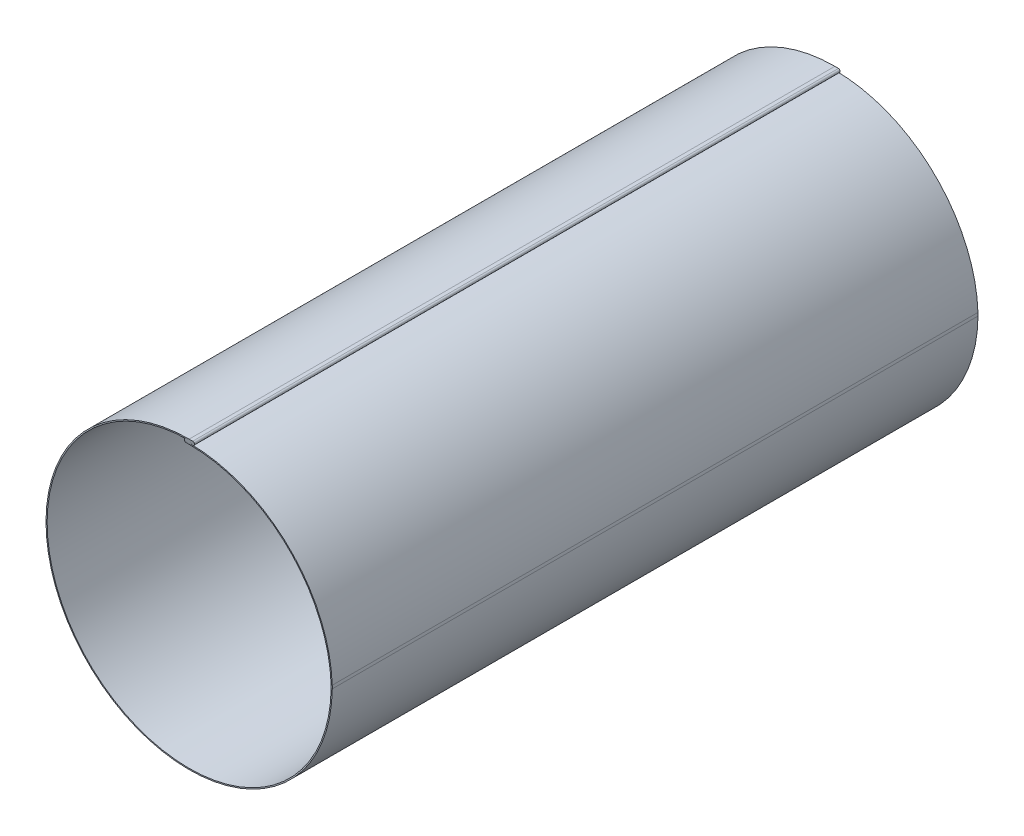
ISO-10303-21;
HEADER;
FILE_DESCRIPTION(('STEP AP214'),'2;1');
FILE_NAME('part.step','',(''),(''),'','','');
FILE_SCHEMA(('AUTOMOTIVE_DESIGN { 1 0 10303 214 1 1 1 1 }'));
ENDSEC;
DATA;
#1=APPLICATION_CONTEXT('core data for automotive mechanical design processes');
#2=APPLICATION_PROTOCOL_DEFINITION('international standard','automotive_design',2000,#1);
#3=PRODUCT_CONTEXT('',#1,'mechanical');
#4=PRODUCT('Part','Part','',(#3));
#5=PRODUCT_RELATED_PRODUCT_CATEGORY('part','',(#4));
#6=PRODUCT_DEFINITION_FORMATION('','',#4);
#7=PRODUCT_DEFINITION_CONTEXT('part definition',#1,'design');
#8=PRODUCT_DEFINITION('design','',#6,#7);
#9=PRODUCT_DEFINITION_SHAPE('','',#8);
#10=(LENGTH_UNIT() NAMED_UNIT(*) SI_UNIT(.MILLI.,.METRE.));
#11=(NAMED_UNIT(*) PLANE_ANGLE_UNIT() SI_UNIT($,.RADIAN.));
#12=(NAMED_UNIT(*) SI_UNIT($,.STERADIAN.) SOLID_ANGLE_UNIT());
#13=UNCERTAINTY_MEASURE_WITH_UNIT(LENGTH_MEASURE(1.E-05),#10,'distance_accuracy_value','');
#14=(GEOMETRIC_REPRESENTATION_CONTEXT(3) GLOBAL_UNCERTAINTY_ASSIGNED_CONTEXT((#13)) GLOBAL_UNIT_ASSIGNED_CONTEXT((#10,
#11,#12)) REPRESENTATION_CONTEXT('',''));
#15=CARTESIAN_POINT('',(0.,0.,0.));
#16=DIRECTION('',(0.,0.,1.));
#17=DIRECTION('',(1.,0.,0.));
#18=AXIS2_PLACEMENT_3D('',#15,#16,#17);
#19=CARTESIAN_POINT('',(0.,158.5,357.5));
#20=DIRECTION('',(0.,0.,1.));
#21=DIRECTION('',(1.,0.,0.));
#22=AXIS2_PLACEMENT_3D('',#19,#20,#21);
#23=PLANE('',#22);
#24=DIRECTION('',(0.,-1.,0.));
#25=VECTOR('',#24,1.);
#26=CARTESIAN_POINT('',(0.,158.5,357.5));
#27=LINE('',#26,#25);
#28=CARTESIAN_POINT('',(0.,158.5,357.5));
#29=VERTEX_POINT('',#28);
#30=CARTESIAN_POINT('',(0.,157.25,357.5));
#31=VERTEX_POINT('',#30);
#32=EDGE_CURVE('E11',#29,#31,#27,.T.);
#33=ORIENTED_EDGE('',*,*,#32,.F.);
#34=CARTESIAN_POINT('',(0.,0.,357.5));
#35=DIRECTION('',(0.,0.,1.));
#36=DIRECTION('',(1.,0.,0.));
#37=AXIS2_PLACEMENT_3D('',#34,#35,#36);
#38=CIRCLE('',#37,158.5);
#39=CARTESIAN_POINT('',(158.490468474023,-1.73821830755222,357.5));
#40=VERTEX_POINT('',#39);
#41=EDGE_CURVE('E170',#29,#40,#38,.T.);
#42=ORIENTED_EDGE('',*,*,#41,.T.);
#43=DIRECTION('',(-0.99993986418942,0.0109666770192557,0.));
#44=VECTOR('',#43,1.);
#45=CARTESIAN_POINT('',(158.490468474023,-1.73821830755222,357.5));
#46=LINE('',#45,#44);
#47=CARTESIAN_POINT('',(157.240543643786,-1.72450996127815,357.5));
#48=VERTEX_POINT('',#47);
#49=EDGE_CURVE('E160',#40,#48,#46,.T.);
#50=ORIENTED_EDGE('',*,*,#49,.T.);
#51=CARTESIAN_POINT('',(0.,0.,357.5));
#52=DIRECTION('',(0.,0.,1.));
#53=DIRECTION('',(1.,0.,0.));
#54=AXIS2_PLACEMENT_3D('',#51,#52,#53);
#55=CIRCLE('',#54,157.25);
#56=EDGE_CURVE('E294',#31,#48,#55,.T.);
#57=ORIENTED_EDGE('',*,*,#56,.F.);
#58=EDGE_LOOP('',(#33,#42,#50,#57));
#59=FACE_BOUND('',#58,.T.);
#60=ADVANCED_FACE('F42',(#59),#23,.T.);
#61=CARTESIAN_POINT('',(0.,157.25,-357.5));
#62=DIRECTION('',(0.,0.,-1.));
#63=DIRECTION('',(-1.,0.,0.));
#64=AXIS2_PLACEMENT_3D('',#61,#62,#63);
#65=PLANE('',#64);
#66=DIRECTION('',(0.,1.,0.));
#67=VECTOR('',#66,1.);
#68=CARTESIAN_POINT('',(0.,157.25,-357.5));
#69=LINE('',#68,#67);
#70=CARTESIAN_POINT('',(0.,157.25,-357.5));
#71=VERTEX_POINT('',#70);
#72=CARTESIAN_POINT('',(0.,158.5,-357.5));
#73=VERTEX_POINT('',#72);
#74=EDGE_CURVE('E50',#71,#73,#69,.T.);
#75=ORIENTED_EDGE('',*,*,#74,.F.);
#76=CARTESIAN_POINT('',(0.,0.,-357.5));
#77=DIRECTION('',(0.,0.,1.));
#78=DIRECTION('',(1.,0.,0.));
#79=AXIS2_PLACEMENT_3D('',#76,#77,#78);
#80=CIRCLE('',#79,157.25);
#81=CARTESIAN_POINT('',(157.240543643786,-1.72450996127815,-357.5));
#82=VERTEX_POINT('',#81);
#83=EDGE_CURVE('E208',#71,#82,#80,.T.);
#84=ORIENTED_EDGE('',*,*,#83,.T.);
#85=DIRECTION('',(0.99993986418942,-0.0109666770192557,0.));
#86=VECTOR('',#85,1.);
#87=CARTESIAN_POINT('',(157.240543643786,-1.72450996127815,-357.5));
#88=LINE('',#87,#86);
#89=CARTESIAN_POINT('',(158.490468474023,-1.73821830755222,-357.5));
#90=VERTEX_POINT('',#89);
#91=EDGE_CURVE('E260',#82,#90,#88,.T.);
#92=ORIENTED_EDGE('',*,*,#91,.T.);
#93=CARTESIAN_POINT('',(0.,0.,-357.5));
#94=DIRECTION('',(0.,0.,1.));
#95=DIRECTION('',(1.,0.,0.));
#96=AXIS2_PLACEMENT_3D('',#93,#94,#95);
#97=CIRCLE('',#96,158.5);
#98=EDGE_CURVE('E220',#73,#90,#97,.T.);
#99=ORIENTED_EDGE('',*,*,#98,.F.);
#100=EDGE_LOOP('',(#75,#84,#92,#99));
#101=FACE_BOUND('',#100,.T.);
#102=ADVANCED_FACE('F283',(#101),#65,.T.);
#103=CARTESIAN_POINT('',(0.732654514278761,154.749281021682,357.5));
#104=DIRECTION('',(0.,0.,1.));
#105=DIRECTION('',(1.,0.,0.));
#106=AXIS2_PLACEMENT_3D('',#103,#104,#105);
#107=PLANE('',#106);
#108=DIRECTION('',(-0.00434262118715934,-0.999990570776157,0.));
#109=VECTOR('',#108,1.);
#110=CARTESIAN_POINT('',(0.732654514278761,154.749281021682,357.5));
#111=LINE('',#110,#109);
#112=CARTESIAN_POINT('',(0.732654514278761,154.749281021682,357.5));
#113=VERTEX_POINT('',#112);
#114=CARTESIAN_POINT('',(0.727226237794811,153.499292808212,357.5));
#115=VERTEX_POINT('',#114);
#116=EDGE_CURVE('E267',#113,#115,#111,.T.);
#117=ORIENTED_EDGE('',*,*,#116,.F.);
#118=CARTESIAN_POINT('',(0.401529648757352,78.5,357.5));
#119=DIRECTION('',(0.,0.,1.));
#120=DIRECTION('',(1.,0.,0.));
#121=AXIS2_PLACEMENT_3D('',#118,#119,#120);
#122=CIRCLE('',#121,76.25);
#123=CARTESIAN_POINT('',(0.401529648757352,154.75,357.5));
#124=VERTEX_POINT('',#123);
#125=EDGE_CURVE('E185',#113,#124,#122,.T.);
#126=ORIENTED_EDGE('',*,*,#125,.T.);
#127=DIRECTION('',(0.,1.,0.));
#128=VECTOR('',#127,1.);
#129=CARTESIAN_POINT('',(0.401529648757352,153.5,357.5));
#130=LINE('',#129,#128);
#131=CARTESIAN_POINT('',(0.401529648757352,153.5,357.5));
#132=VERTEX_POINT('',#131);
#133=EDGE_CURVE('E58',#132,#124,#130,.T.);
#134=ORIENTED_EDGE('',*,*,#133,.F.);
#135=CARTESIAN_POINT('',(0.401529648757352,78.5,357.5));
#136=DIRECTION('',(0.,0.,1.));
#137=DIRECTION('',(1.,0.,0.));
#138=AXIS2_PLACEMENT_3D('',#135,#136,#137);
#139=CIRCLE('',#138,75.);
#140=EDGE_CURVE('E314',#115,#132,#139,.T.);
#141=ORIENTED_EDGE('',*,*,#140,.F.);
#142=EDGE_LOOP('',(#117,#126,#134,#141));
#143=FACE_BOUND('',#142,.T.);
#144=ADVANCED_FACE('F517',(#143),#107,.T.);
#145=CARTESIAN_POINT('',(0.401529648757352,153.5,357.5));
#146=DIRECTION('',(0.,0.,1.));
#147=DIRECTION('',(1.,0.,0.));
#148=AXIS2_PLACEMENT_3D('',#145,#146,#147);
#149=PLANE('',#148);
#150=CARTESIAN_POINT('',(0.0443490561129467,-3.74922444633893,357.5));
#151=DIRECTION('',(0.,0.,1.));
#152=DIRECTION('',(1.,0.,0.));
#153=AXIS2_PLACEMENT_3D('',#150,#151,#152);
#154=CIRCLE('',#153,158.5);
#155=CARTESIAN_POINT('',(158.449354607414,1.73750648312673,357.5));
#156=VERTEX_POINT('',#155);
#157=EDGE_CURVE('E152',#156,#113,#154,.T.);
#158=ORIENTED_EDGE('',*,*,#157,.T.);
#159=ORIENTED_EDGE('',*,*,#116,.T.);
#160=CARTESIAN_POINT('',(0.0443490561129467,-3.74922444633893,357.5));
#161=DIRECTION('',(0.,0.,1.));
#162=DIRECTION('',(1.,0.,0.));
#163=AXIS2_PLACEMENT_3D('',#160,#161,#162);
#164=CIRCLE('',#163,157.25);
#165=CARTESIAN_POINT('',(157.20010377499,1.69423573447164,357.5));
#166=VERTEX_POINT('',#165);
#167=EDGE_CURVE('E155',#166,#115,#164,.T.);
#168=ORIENTED_EDGE('',*,*,#167,.F.);
#169=DIRECTION('',(0.999400665938806,0.0346165989240743,0.));
#170=VECTOR('',#169,1.);
#171=CARTESIAN_POINT('',(157.20010377499,1.69423573447164,357.5));
#172=LINE('',#171,#170);
#173=EDGE_CURVE('E148',#166,#156,#172,.T.);
#174=ORIENTED_EDGE('',*,*,#173,.T.);
#175=EDGE_LOOP('',(#158,#159,#168,#174));
#176=FACE_BOUND('',#175,.T.);
#177=ADVANCED_FACE('F150',(#176),#149,.T.);
#178=CARTESIAN_POINT('',(0.401529648757352,154.75,-357.5));
#179=DIRECTION('',(0.,0.,-1.));
#180=DIRECTION('',(-1.,0.,0.));
#181=AXIS2_PLACEMENT_3D('',#178,#179,#180);
#182=PLANE('',#181);
#183=DIRECTION('',(0.,-1.,0.));
#184=VECTOR('',#183,1.);
#185=CARTESIAN_POINT('',(0.401529648757352,154.75,-357.5));
#186=LINE('',#185,#184);
#187=CARTESIAN_POINT('',(0.401529648757352,154.75,-357.5));
#188=VERTEX_POINT('',#187);
#189=CARTESIAN_POINT('',(0.401529648757352,153.5,-357.5));
#190=VERTEX_POINT('',#189);
#191=EDGE_CURVE('E107',#188,#190,#186,.T.);
#192=ORIENTED_EDGE('',*,*,#191,.F.);
#193=CARTESIAN_POINT('',(0.401529648757352,78.5,-357.5));
#194=DIRECTION('',(0.,0.,1.));
#195=DIRECTION('',(1.,0.,0.));
#196=AXIS2_PLACEMENT_3D('',#193,#194,#195);
#197=CIRCLE('',#196,76.25);
#198=CARTESIAN_POINT('',(0.732654514278761,154.749281021682,-357.5));
#199=VERTEX_POINT('',#198);
#200=EDGE_CURVE('E226',#199,#188,#197,.T.);
#201=ORIENTED_EDGE('',*,*,#200,.F.);
#202=DIRECTION('',(0.00434262118715934,0.999990570776157,0.));
#203=VECTOR('',#202,1.);
#204=CARTESIAN_POINT('',(0.727226237794811,153.499292808212,-357.5));
#205=LINE('',#204,#203);
#206=CARTESIAN_POINT('',(0.727226237794811,153.499292808212,-357.5));
#207=VERTEX_POINT('',#206);
#208=EDGE_CURVE('E100',#207,#199,#205,.T.);
#209=ORIENTED_EDGE('',*,*,#208,.F.);
#210=CARTESIAN_POINT('',(0.401529648757352,78.5,-357.5));
#211=DIRECTION('',(0.,0.,1.));
#212=DIRECTION('',(1.,0.,0.));
#213=AXIS2_PLACEMENT_3D('',#210,#211,#212);
#214=CIRCLE('',#213,75.);
#215=EDGE_CURVE('E201',#207,#190,#214,.T.);
#216=ORIENTED_EDGE('',*,*,#215,.T.);
#217=EDGE_LOOP('',(#192,#201,#209,#216));
#218=FACE_BOUND('',#217,.T.);
#219=ADVANCED_FACE('F307',(#218),#182,.T.);
#220=CARTESIAN_POINT('',(0.727226237794811,153.499292808212,-357.5));
#221=DIRECTION('',(0.,0.,-1.));
#222=DIRECTION('',(-1.,0.,0.));
#223=AXIS2_PLACEMENT_3D('',#220,#221,#222);
#224=PLANE('',#223);
#225=DIRECTION('',(-1.,0.,0.));
#226=VECTOR('',#225,1.);
#227=CARTESIAN_POINT('',(0.540181597477021,154.75,-357.5));
#228=LINE('',#227,#226);
#229=CARTESIAN_POINT('',(-3.45981840252298,154.75,-357.5));
#230=VERTEX_POINT('',#229);
#231=EDGE_CURVE('E191',#188,#230,#228,.T.);
#232=ORIENTED_EDGE('',*,*,#231,.F.);
#233=ORIENTED_EDGE('',*,*,#191,.T.);
#234=DIRECTION('',(1.,0.,0.));
#235=VECTOR('',#234,1.);
#236=CARTESIAN_POINT('',(0.540181597477021,153.5,-357.5));
#237=LINE('',#236,#235);
#238=CARTESIAN_POINT('',(-3.45981840252298,153.5,-357.5));
#239=VERTEX_POINT('',#238);
#240=EDGE_CURVE('E198',#190,#239,#237,.F.);
#241=ORIENTED_EDGE('',*,*,#240,.T.);
#242=DIRECTION('',(0.,1.,0.));
#243=VECTOR('',#242,1.);
#244=CARTESIAN_POINT('',(-3.45981840252298,153.5,-357.5));
#245=LINE('',#244,#243);
#246=EDGE_CURVE('E194',#239,#230,#245,.T.);
#247=ORIENTED_EDGE('',*,*,#246,.T.);
#248=EDGE_LOOP('',(#232,#233,#241,#247));
#249=FACE_BOUND('',#248,.T.);
#250=ADVANCED_FACE('F322',(#249),#224,.T.);
#251=CARTESIAN_POINT('',(158.490468474023,-1.73821830755222,357.5));
#252=DIRECTION('',(0.,0.,1.));
#253=DIRECTION('',(1.,0.,0.));
#254=AXIS2_PLACEMENT_3D('',#251,#252,#253);
#255=PLANE('',#254);
#256=ORIENTED_EDGE('',*,*,#49,.F.);
#257=CARTESIAN_POINT('',(82.2450538295798,-0.902009184833881,357.5));
#258=DIRECTION('',(0.,0.,1.));
#259=DIRECTION('',(1.,0.,0.));
#260=AXIS2_PLACEMENT_3D('',#257,#258,#259);
#261=CIRCLE('',#260,76.25);
#262=EDGE_CURVE('E164',#40,#156,#261,.T.);
#263=ORIENTED_EDGE('',*,*,#262,.T.);
#264=ORIENTED_EDGE('',*,*,#173,.F.);
#265=CARTESIAN_POINT('',(82.2450538295798,-0.902009184833881,357.5));
#266=DIRECTION('',(0.,0.,1.));
#267=DIRECTION('',(1.,0.,0.));
#268=AXIS2_PLACEMENT_3D('',#265,#266,#267);
#269=CIRCLE('',#268,75.);
#270=EDGE_CURVE('E298',#48,#166,#269,.T.);
#271=ORIENTED_EDGE('',*,*,#270,.F.);
#272=EDGE_LOOP('',(#256,#263,#264,#271));
#273=FACE_BOUND('',#272,.T.);
#274=ADVANCED_FACE('F166',(#273),#255,.T.);
#275=CARTESIAN_POINT('',(157.20010377499,1.69423573447164,357.5));
#276=DIRECTION('',(0.,0.,1.));
#277=DIRECTION('',(1.,0.,0.));
#278=AXIS2_PLACEMENT_3D('',#275,#276,#277);
#279=PLANE('',#278);
#280=DIRECTION('',(-1.,0.,0.));
#281=VECTOR('',#280,1.);
#282=CARTESIAN_POINT('',(0.,158.5,357.5));
#283=LINE('',#282,#281);
#284=CARTESIAN_POINT('',(4.,158.5,357.5));
#285=VERTEX_POINT('',#284);
#286=EDGE_CURVE('E446',#285,#29,#283,.T.);
#287=ORIENTED_EDGE('',*,*,#286,.T.);
#288=ORIENTED_EDGE('',*,*,#32,.T.);
#289=DIRECTION('',(1.,0.,0.));
#290=VECTOR('',#289,1.);
#291=CARTESIAN_POINT('',(0.,157.25,357.5));
#292=LINE('',#291,#290);
#293=CARTESIAN_POINT('',(4.,157.25,357.5));
#294=VERTEX_POINT('',#293);
#295=EDGE_CURVE('E440',#294,#31,#292,.F.);
#296=ORIENTED_EDGE('',*,*,#295,.F.);
#297=DIRECTION('',(0.,-1.,0.));
#298=VECTOR('',#297,1.);
#299=CARTESIAN_POINT('',(4.,158.5,357.5));
#300=LINE('',#299,#298);
#301=EDGE_CURVE('E443',#285,#294,#300,.T.);
#302=ORIENTED_EDGE('',*,*,#301,.F.);
#303=EDGE_LOOP('',(#287,#288,#296,#302));
#304=FACE_BOUND('',#303,.T.);
#305=ADVANCED_FACE('F452',(#304),#279,.T.);
#306=CARTESIAN_POINT('',(158.449354607414,1.73750648312673,-357.5));
#307=DIRECTION('',(0.,0.,-1.));
#308=DIRECTION('',(-1.,0.,0.));
#309=AXIS2_PLACEMENT_3D('',#306,#307,#308);
#310=PLANE('',#309);
#311=DIRECTION('',(-0.999400665938806,-0.0346165989240743,0.));
#312=VECTOR('',#311,1.);
#313=CARTESIAN_POINT('',(158.449354607414,1.73750648312673,-357.5));
#314=LINE('',#313,#312);
#315=CARTESIAN_POINT('',(158.449354607414,1.73750648312673,-357.5));
#316=VERTEX_POINT('',#315);
#317=CARTESIAN_POINT('',(157.20010377499,1.69423573447164,-357.5));
#318=VERTEX_POINT('',#317);
#319=EDGE_CURVE('E161',#316,#318,#314,.T.);
#320=ORIENTED_EDGE('',*,*,#319,.F.);
#321=CARTESIAN_POINT('',(82.2450538295798,-0.902009184833881,-357.5));
#322=DIRECTION('',(0.,0.,1.));
#323=DIRECTION('',(1.,0.,0.));
#324=AXIS2_PLACEMENT_3D('',#321,#322,#323);
#325=CIRCLE('',#324,76.25);
#326=EDGE_CURVE('E177',#90,#316,#325,.T.);
#327=ORIENTED_EDGE('',*,*,#326,.F.);
#328=ORIENTED_EDGE('',*,*,#91,.F.);
#329=CARTESIAN_POINT('',(82.2450538295798,-0.902009184833881,-357.5));
#330=DIRECTION('',(0.,0.,1.));
#331=DIRECTION('',(1.,0.,0.));
#332=AXIS2_PLACEMENT_3D('',#329,#330,#331);
#333=CIRCLE('',#332,75.);
#334=EDGE_CURVE('E205',#82,#318,#333,.T.);
#335=ORIENTED_EDGE('',*,*,#334,.T.);
#336=EDGE_LOOP('',(#320,#327,#328,#335));
#337=FACE_BOUND('',#336,.T.);
#338=ADVANCED_FACE('F286',(#337),#310,.T.);
#339=CARTESIAN_POINT('',(157.240543643786,-1.72450996127815,-357.5));
#340=DIRECTION('',(0.,0.,-1.));
#341=DIRECTION('',(-1.,0.,0.));
#342=AXIS2_PLACEMENT_3D('',#339,#340,#341);
#343=PLANE('',#342);
#344=CARTESIAN_POINT('',(0.0443490561129467,-3.74922444633893,-357.5));
#345=DIRECTION('',(0.,0.,1.));
#346=DIRECTION('',(1.,0.,0.));
#347=AXIS2_PLACEMENT_3D('',#344,#345,#346);
#348=CIRCLE('',#347,158.5);
#349=EDGE_CURVE('E224',#316,#199,#348,.T.);
#350=ORIENTED_EDGE('',*,*,#349,.F.);
#351=ORIENTED_EDGE('',*,*,#319,.T.);
#352=CARTESIAN_POINT('',(0.0443490561129467,-3.74922444633893,-357.5));
#353=DIRECTION('',(0.,0.,1.));
#354=DIRECTION('',(1.,0.,0.));
#355=AXIS2_PLACEMENT_3D('',#352,#353,#354);
#356=CIRCLE('',#355,157.25);
#357=EDGE_CURVE('E203',#318,#207,#356,.T.);
#358=ORIENTED_EDGE('',*,*,#357,.T.);
#359=ORIENTED_EDGE('',*,*,#208,.T.);
#360=EDGE_LOOP('',(#350,#351,#358,#359));
#361=FACE_BOUND('',#360,.T.);
#362=ADVANCED_FACE('F303',(#361),#343,.T.);
#363=CARTESIAN_POINT('',(0.540181597477021,154.75,357.5));
#364=DIRECTION('',(0.,-1.,0.));
#365=DIRECTION('',(0.,0.,-1.));
#366=AXIS2_PLACEMENT_3D('',#363,#364,#365);
#367=PLANE('',#366);
#368=ORIENTED_EDGE('',*,*,#231,.T.);
#369=DIRECTION('',(0.,0.,-1.));
#370=VECTOR('',#369,1.);
#371=CARTESIAN_POINT('',(-3.45981840252298,154.75,357.5));
#372=LINE('',#371,#370);
#373=CARTESIAN_POINT('',(-3.45981840252298,154.75,357.5));
#374=VERTEX_POINT('',#373);
#375=EDGE_CURVE('E257',#374,#230,#372,.T.);
#376=ORIENTED_EDGE('',*,*,#375,.F.);
#377=DIRECTION('',(-1.,0.,0.));
#378=VECTOR('',#377,1.);
#379=CARTESIAN_POINT('',(0.540181597477021,154.75,357.5));
#380=LINE('',#379,#378);
#381=EDGE_CURVE('E113',#124,#374,#380,.T.);
#382=ORIENTED_EDGE('',*,*,#381,.F.);
#383=DIRECTION('',(0.,0.,-1.));
#384=VECTOR('',#383,1.);
#385=CARTESIAN_POINT('',(0.401529648757352,154.75,357.5));
#386=LINE('',#385,#384);
#387=EDGE_CURVE('E187',#124,#188,#386,.T.);
#388=ORIENTED_EDGE('',*,*,#387,.T.);
#389=EDGE_LOOP('',(#368,#376,#382,#388));
#390=FACE_BOUND('',#389,.T.);
#391=ADVANCED_FACE('F538',(#390),#367,.F.);
#392=CARTESIAN_POINT('',(0.540181597477021,153.5,357.5));
#393=DIRECTION('',(0.,-1.,0.));
#394=DIRECTION('',(0.,0.,-1.));
#395=AXIS2_PLACEMENT_3D('',#392,#393,#394);
#396=PLANE('',#395);
#397=ORIENTED_EDGE('',*,*,#240,.F.);
#398=DIRECTION('',(0.,0.,-1.));
#399=VECTOR('',#398,1.);
#400=CARTESIAN_POINT('',(0.401529648757352,153.5,357.5));
#401=LINE('',#400,#399);
#402=EDGE_CURVE('E252',#132,#190,#401,.T.);
#403=ORIENTED_EDGE('',*,*,#402,.F.);
#404=DIRECTION('',(1.,0.,0.));
#405=VECTOR('',#404,1.);
#406=CARTESIAN_POINT('',(0.540181597477021,153.5,357.5));
#407=LINE('',#406,#405);
#408=CARTESIAN_POINT('',(-3.45981840252298,153.5,357.5));
#409=VERTEX_POINT('',#408);
#410=EDGE_CURVE('E434',#132,#409,#407,.F.);
#411=ORIENTED_EDGE('',*,*,#410,.T.);
#412=DIRECTION('',(0.,0.,-1.));
#413=VECTOR('',#412,1.);
#414=CARTESIAN_POINT('',(-3.45981840252298,153.5,357.5));
#415=LINE('',#414,#413);
#416=EDGE_CURVE('E255',#409,#239,#415,.T.);
#417=ORIENTED_EDGE('',*,*,#416,.T.);
#418=EDGE_LOOP('',(#397,#403,#411,#417));
#419=FACE_BOUND('',#418,.T.);
#420=ADVANCED_FACE('F317',(#419),#396,.T.);
#421=CARTESIAN_POINT('',(0.401529648757352,78.5,357.5));
#422=DIRECTION('',(0.,0.,-1.));
#423=DIRECTION('',(-1.,0.,0.));
#424=AXIS2_PLACEMENT_3D('',#421,#422,#423);
#425=CYLINDRICAL_SURFACE('',#424,75.);
#426=ORIENTED_EDGE('',*,*,#215,.F.);
#427=DIRECTION('',(0.,0.,-1.));
#428=VECTOR('',#427,1.);
#429=CARTESIAN_POINT('',(0.727226237794811,153.499292808212,357.5));
#430=LINE('',#429,#428);
#431=EDGE_CURVE('E249',#115,#207,#430,.T.);
#432=ORIENTED_EDGE('',*,*,#431,.F.);
#433=ORIENTED_EDGE('',*,*,#140,.T.);
#434=ORIENTED_EDGE('',*,*,#402,.T.);
#435=EDGE_LOOP('',(#426,#432,#433,#434));
#436=FACE_BOUND('',#435,.T.);
#437=ADVANCED_FACE('F309',(#436),#425,.F.);
#438=CARTESIAN_POINT('',(0.0443490561129467,-3.74922444633893,357.5));
#439=DIRECTION('',(0.,0.,-1.));
#440=DIRECTION('',(-1.,0.,0.));
#441=AXIS2_PLACEMENT_3D('',#438,#439,#440);
#442=CYLINDRICAL_SURFACE('',#441,157.25);
#443=ORIENTED_EDGE('',*,*,#357,.F.);
#444=DIRECTION('',(0.,0.,-1.));
#445=VECTOR('',#444,1.);
#446=CARTESIAN_POINT('',(157.20010377499,1.69423573447164,357.5));
#447=LINE('',#446,#445);
#448=EDGE_CURVE('E246',#166,#318,#447,.T.);
#449=ORIENTED_EDGE('',*,*,#448,.F.);
#450=ORIENTED_EDGE('',*,*,#167,.T.);
#451=ORIENTED_EDGE('',*,*,#431,.T.);
#452=EDGE_LOOP('',(#443,#449,#450,#451));
#453=FACE_BOUND('',#452,.T.);
#454=ADVANCED_FACE('F300',(#453),#442,.F.);
#455=CARTESIAN_POINT('',(82.2450538295798,-0.902009184833881,357.5));
#456=DIRECTION('',(0.,0.,-1.));
#457=DIRECTION('',(-1.,0.,0.));
#458=AXIS2_PLACEMENT_3D('',#455,#456,#457);
#459=CYLINDRICAL_SURFACE('',#458,75.);
#460=ORIENTED_EDGE('',*,*,#334,.F.);
#461=DIRECTION('',(0.,0.,-1.));
#462=VECTOR('',#461,1.);
#463=CARTESIAN_POINT('',(157.240543643786,-1.72450996127815,357.5));
#464=LINE('',#463,#462);
#465=EDGE_CURVE('E243',#48,#82,#464,.T.);
#466=ORIENTED_EDGE('',*,*,#465,.F.);
#467=ORIENTED_EDGE('',*,*,#270,.T.);
#468=ORIENTED_EDGE('',*,*,#448,.T.);
#469=EDGE_LOOP('',(#460,#466,#467,#468));
#470=FACE_BOUND('',#469,.T.);
#471=ADVANCED_FACE('F296',(#470),#459,.F.);
#472=CARTESIAN_POINT('',(0.,0.,357.5));
#473=DIRECTION('',(0.,0.,-1.));
#474=DIRECTION('',(-1.,0.,0.));
#475=AXIS2_PLACEMENT_3D('',#472,#473,#474);
#476=CYLINDRICAL_SURFACE('',#475,157.25);
#477=ORIENTED_EDGE('',*,*,#83,.F.);
#478=DIRECTION('',(0.,0.,-1.));
#479=VECTOR('',#478,1.);
#480=CARTESIAN_POINT('',(0.,157.25,357.5));
#481=LINE('',#480,#479);
#482=EDGE_CURVE('E240',#31,#71,#481,.T.);
#483=ORIENTED_EDGE('',*,*,#482,.F.);
#484=ORIENTED_EDGE('',*,*,#56,.T.);
#485=ORIENTED_EDGE('',*,*,#465,.T.);
#486=EDGE_LOOP('',(#477,#483,#484,#485));
#487=FACE_BOUND('',#486,.T.);
#488=ADVANCED_FACE('F291',(#487),#476,.F.);
#489=CARTESIAN_POINT('',(0.,157.25,357.5));
#490=DIRECTION('',(0.,-1.,0.));
#491=DIRECTION('',(0.,0.,-1.));
#492=AXIS2_PLACEMENT_3D('',#489,#490,#491);
#493=PLANE('',#492);
#494=DIRECTION('',(1.,0.,0.));
#495=VECTOR('',#494,1.);
#496=CARTESIAN_POINT('',(0.,157.25,-357.5));
#497=LINE('',#496,#495);
#498=CARTESIAN_POINT('',(4.,157.25,-357.5));
#499=VERTEX_POINT('',#498);
#500=EDGE_CURVE('E211',#499,#71,#497,.F.);
#501=ORIENTED_EDGE('',*,*,#500,.F.);
#502=DIRECTION('',(0.,0.,-1.));
#503=VECTOR('',#502,1.);
#504=CARTESIAN_POINT('',(4.,157.25,357.5));
#505=LINE('',#504,#503);
#506=EDGE_CURVE('E237',#294,#499,#505,.T.);
#507=ORIENTED_EDGE('',*,*,#506,.F.);
#508=ORIENTED_EDGE('',*,*,#295,.T.);
#509=ORIENTED_EDGE('',*,*,#482,.T.);
#510=EDGE_LOOP('',(#501,#507,#508,#509));
#511=FACE_BOUND('',#510,.T.);
#512=ADVANCED_FACE('F552',(#511),#493,.T.);
#513=CARTESIAN_POINT('',(0.,158.5,357.5));
#514=DIRECTION('',(0.,-1.,0.));
#515=DIRECTION('',(0.,0.,-1.));
#516=AXIS2_PLACEMENT_3D('',#513,#514,#515);
#517=PLANE('',#516);
#518=DIRECTION('',(-1.,0.,0.));
#519=VECTOR('',#518,1.);
#520=CARTESIAN_POINT('',(0.,158.5,-357.5));
#521=LINE('',#520,#519);
#522=CARTESIAN_POINT('',(4.,158.5,-357.5));
#523=VERTEX_POINT('',#522);
#524=EDGE_CURVE('E217',#523,#73,#521,.T.);
#525=ORIENTED_EDGE('',*,*,#524,.T.);
#526=DIRECTION('',(0.,0.,-1.));
#527=VECTOR('',#526,1.);
#528=CARTESIAN_POINT('',(0.,158.5,357.5));
#529=LINE('',#528,#527);
#530=EDGE_CURVE('E232',#29,#73,#529,.T.);
#531=ORIENTED_EDGE('',*,*,#530,.F.);
#532=ORIENTED_EDGE('',*,*,#286,.F.);
#533=DIRECTION('',(0.,0.,-1.));
#534=VECTOR('',#533,1.);
#535=CARTESIAN_POINT('',(4.,158.5,357.5));
#536=LINE('',#535,#534);
#537=EDGE_CURVE('E235',#285,#523,#536,.T.);
#538=ORIENTED_EDGE('',*,*,#537,.T.);
#539=EDGE_LOOP('',(#525,#531,#532,#538));
#540=FACE_BOUND('',#539,.T.);
#541=ADVANCED_FACE('F277',(#540),#517,.F.);
#542=CARTESIAN_POINT('',(0.,0.,357.5));
#543=DIRECTION('',(0.,0.,-1.));
#544=DIRECTION('',(-1.,0.,0.));
#545=AXIS2_PLACEMENT_3D('',#542,#543,#544);
#546=CYLINDRICAL_SURFACE('',#545,158.5);
#547=ORIENTED_EDGE('',*,*,#98,.T.);
#548=DIRECTION('',(0.,0.,-1.));
#549=VECTOR('',#548,1.);
#550=CARTESIAN_POINT('',(158.490468474023,-1.73821830755222,357.5));
#551=LINE('',#550,#549);
#552=EDGE_CURVE('E179',#40,#90,#551,.T.);
#553=ORIENTED_EDGE('',*,*,#552,.F.);
#554=ORIENTED_EDGE('',*,*,#41,.F.);
#555=ORIENTED_EDGE('',*,*,#530,.T.);
#556=EDGE_LOOP('',(#547,#553,#554,#555));
#557=FACE_BOUND('',#556,.T.);
#558=ADVANCED_FACE('F281',(#557),#546,.T.);
#559=CARTESIAN_POINT('',(82.2450538295798,-0.902009184833881,357.5));
#560=DIRECTION('',(0.,0.,-1.));
#561=DIRECTION('',(-1.,0.,0.));
#562=AXIS2_PLACEMENT_3D('',#559,#560,#561);
#563=CYLINDRICAL_SURFACE('',#562,76.25);
#564=ORIENTED_EDGE('',*,*,#326,.T.);
#565=DIRECTION('',(0.,0.,-1.));
#566=VECTOR('',#565,1.);
#567=CARTESIAN_POINT('',(158.449354607414,1.73750648312673,357.5));
#568=LINE('',#567,#566);
#569=EDGE_CURVE('E174',#156,#316,#568,.T.);
#570=ORIENTED_EDGE('',*,*,#569,.F.);
#571=ORIENTED_EDGE('',*,*,#262,.F.);
#572=ORIENTED_EDGE('',*,*,#552,.T.);
#573=EDGE_LOOP('',(#564,#570,#571,#572));
#574=FACE_BOUND('',#573,.T.);
#575=ADVANCED_FACE('F175',(#574),#563,.T.);
#576=CARTESIAN_POINT('',(0.0443490561129467,-3.74922444633893,357.5));
#577=DIRECTION('',(0.,0.,-1.));
#578=DIRECTION('',(-1.,0.,0.));
#579=AXIS2_PLACEMENT_3D('',#576,#577,#578);
#580=CYLINDRICAL_SURFACE('',#579,158.5);
#581=ORIENTED_EDGE('',*,*,#349,.T.);
#582=DIRECTION('',(0.,0.,-1.));
#583=VECTOR('',#582,1.);
#584=CARTESIAN_POINT('',(0.732654514278761,154.749281021682,357.5));
#585=LINE('',#584,#583);
#586=EDGE_CURVE('E180',#113,#199,#585,.T.);
#587=ORIENTED_EDGE('',*,*,#586,.F.);
#588=ORIENTED_EDGE('',*,*,#157,.F.);
#589=ORIENTED_EDGE('',*,*,#569,.T.);
#590=EDGE_LOOP('',(#581,#587,#588,#589));
#591=FACE_BOUND('',#590,.T.);
#592=ADVANCED_FACE('F182',(#591),#580,.T.);
#593=CARTESIAN_POINT('',(0.401529648757352,78.5,357.5));
#594=DIRECTION('',(0.,0.,-1.));
#595=DIRECTION('',(-1.,0.,0.));
#596=AXIS2_PLACEMENT_3D('',#593,#594,#595);
#597=CYLINDRICAL_SURFACE('',#596,76.25);
#598=ORIENTED_EDGE('',*,*,#200,.T.);
#599=ORIENTED_EDGE('',*,*,#387,.F.);
#600=ORIENTED_EDGE('',*,*,#125,.F.);
#601=ORIENTED_EDGE('',*,*,#586,.T.);
#602=EDGE_LOOP('',(#598,#599,#600,#601));
#603=FACE_BOUND('',#602,.T.);
#604=ADVANCED_FACE('F305',(#603),#597,.T.);
#605=CARTESIAN_POINT('',(0.401529648757352,78.5,357.5));
#606=DIRECTION('',(0.,0.,1.));
#607=DIRECTION('',(1.,0.,0.));
#608=AXIS2_PLACEMENT_3D('',#605,#606,#607);
#609=PLANE('',#608);
#610=ORIENTED_EDGE('',*,*,#381,.T.);
#611=DIRECTION('',(0.,1.,0.));
#612=VECTOR('',#611,1.);
#613=CARTESIAN_POINT('',(-3.45981840252298,153.5,357.5));
#614=LINE('',#613,#612);
#615=EDGE_CURVE('E431',#409,#374,#614,.T.);
#616=ORIENTED_EDGE('',*,*,#615,.F.);
#617=ORIENTED_EDGE('',*,*,#410,.F.);
#618=ORIENTED_EDGE('',*,*,#133,.T.);
#619=EDGE_LOOP('',(#610,#616,#617,#618));
#620=FACE_BOUND('',#619,.T.);
#621=ADVANCED_FACE('F566',(#620),#609,.T.);
#622=CARTESIAN_POINT('',(0.401529648757352,78.5,-357.5));
#623=DIRECTION('',(0.,0.,1.));
#624=DIRECTION('',(1.,0.,0.));
#625=AXIS2_PLACEMENT_3D('',#622,#623,#624);
#626=PLANE('',#625);
#627=ORIENTED_EDGE('',*,*,#500,.T.);
#628=ORIENTED_EDGE('',*,*,#74,.T.);
#629=ORIENTED_EDGE('',*,*,#524,.F.);
#630=DIRECTION('',(0.,-1.,0.));
#631=VECTOR('',#630,1.);
#632=CARTESIAN_POINT('',(4.,158.5,-357.5));
#633=LINE('',#632,#631);
#634=EDGE_CURVE('E214',#523,#499,#633,.T.);
#635=ORIENTED_EDGE('',*,*,#634,.T.);
#636=EDGE_LOOP('',(#627,#628,#629,#635));
#637=FACE_BOUND('',#636,.T.);
#638=ADVANCED_FACE('F270',(#637),#626,.F.);
#639=CARTESIAN_POINT('',(-0.0625000000000001,154.75,357.5));
#640=DIRECTION('',(0.,0.,-1.));
#641=DIRECTION('',(1.,0.,0.));
#642=AXIS2_PLACEMENT_3D('',#639,#640,#641);
#643=PLANE('',#642);
#644=DIRECTION('',(0.,-1.,0.));
#645=VECTOR('',#644,1.);
#646=CARTESIAN_POINT('',(4.,154.75,357.5));
#647=LINE('',#646,#645);
#648=CARTESIAN_POINT('',(4.,156.,357.5));
#649=VERTEX_POINT('',#648);
#650=CARTESIAN_POINT('',(4.,154.75,357.5));
#651=VERTEX_POINT('',#650);
#652=EDGE_CURVE('E423',#649,#651,#647,.T.);
#653=ORIENTED_EDGE('',*,*,#652,.F.);
#654=DIRECTION('',(1.,0.,0.));
#655=VECTOR('',#654,1.);
#656=CARTESIAN_POINT('',(-0.0625000000000001,156.,357.5));
#657=LINE('',#656,#655);
#658=CARTESIAN_POINT('',(-4.125,156.,357.5));
#659=VERTEX_POINT('',#658);
#660=EDGE_CURVE('E412',#659,#649,#657,.T.);
#661=ORIENTED_EDGE('',*,*,#660,.F.);
#662=DIRECTION('',(0.,-1.,0.));
#663=VECTOR('',#662,1.);
#664=CARTESIAN_POINT('',(-4.125,154.75,357.5));
#665=LINE('',#664,#663);
#666=CARTESIAN_POINT('',(-4.125,154.75,357.5));
#667=VERTEX_POINT('',#666);
#668=EDGE_CURVE('E420',#659,#667,#665,.T.);
#669=ORIENTED_EDGE('',*,*,#668,.T.);
#670=DIRECTION('',(1.,0.,0.));
#671=VECTOR('',#670,1.);
#672=CARTESIAN_POINT('',(-0.0625000000000001,154.75,357.5));
#673=LINE('',#672,#671);
#674=EDGE_CURVE('E400',#667,#651,#673,.T.);
#675=ORIENTED_EDGE('',*,*,#674,.T.);
#676=EDGE_LOOP('',(#653,#661,#669,#675));
#677=FACE_BOUND('',#676,.T.);
#678=ADVANCED_FACE('F467',(#677),#643,.F.);
#679=CARTESIAN_POINT('',(-4.125,154.75,0.));
#680=DIRECTION('',(1.,0.,0.));
#681=DIRECTION('',(0.,0.,1.));
#682=AXIS2_PLACEMENT_3D('',#679,#680,#681);
#683=PLANE('',#682);
#684=ORIENTED_EDGE('',*,*,#668,.F.);
#685=DIRECTION('',(0.,0.,-1.));
#686=VECTOR('',#685,1.);
#687=CARTESIAN_POINT('',(-4.125,156.,0.));
#688=LINE('',#687,#686);
#689=CARTESIAN_POINT('',(-4.125,156.,-357.5));
#690=VERTEX_POINT('',#689);
#691=EDGE_CURVE('E409',#690,#659,#688,.F.);
#692=ORIENTED_EDGE('',*,*,#691,.F.);
#693=DIRECTION('',(0.,-1.,0.));
#694=VECTOR('',#693,1.);
#695=CARTESIAN_POINT('',(-4.125,154.75,-357.5));
#696=LINE('',#695,#694);
#697=CARTESIAN_POINT('',(-4.125,154.75,-357.5));
#698=VERTEX_POINT('',#697);
#699=EDGE_CURVE('E399',#690,#698,#696,.T.);
#700=ORIENTED_EDGE('',*,*,#699,.T.);
#701=DIRECTION('',(0.,0.,1.));
#702=VECTOR('',#701,1.);
#703=CARTESIAN_POINT('',(-4.125,154.75,0.));
#704=LINE('',#703,#702);
#705=EDGE_CURVE('E396',#698,#667,#704,.T.);
#706=ORIENTED_EDGE('',*,*,#705,.T.);
#707=EDGE_LOOP('',(#684,#692,#700,#706));
#708=FACE_BOUND('',#707,.T.);
#709=ADVANCED_FACE('F502',(#708),#683,.F.);
#710=CARTESIAN_POINT('',(-0.0625000000000001,154.75,-357.5));
#711=DIRECTION('',(0.,0.,1.));
#712=DIRECTION('',(-1.,0.,0.));
#713=AXIS2_PLACEMENT_3D('',#710,#711,#712);
#714=PLANE('',#713);
#715=DIRECTION('',(1.,0.,0.));
#716=VECTOR('',#715,1.);
#717=CARTESIAN_POINT('',(-0.0625000000000001,156.,-357.5));
#718=LINE('',#717,#716);
#719=CARTESIAN_POINT('',(4.,156.,-357.5));
#720=VERTEX_POINT('',#719);
#721=EDGE_CURVE('E387',#720,#690,#718,.F.);
#722=ORIENTED_EDGE('',*,*,#721,.F.);
#723=DIRECTION('',(0.,-1.,0.));
#724=VECTOR('',#723,1.);
#725=CARTESIAN_POINT('',(4.,154.75,-357.5));
#726=LINE('',#725,#724);
#727=CARTESIAN_POINT('',(4.,154.75,-357.5));
#728=VERTEX_POINT('',#727);
#729=EDGE_CURVE('E195',#720,#728,#726,.T.);
#730=ORIENTED_EDGE('',*,*,#729,.T.);
#731=DIRECTION('',(-1.,0.,0.));
#732=VECTOR('',#731,1.);
#733=CARTESIAN_POINT('',(-0.0625000000000001,154.75,-357.5));
#734=LINE('',#733,#732);
#735=EDGE_CURVE('E406',#728,#698,#734,.T.);
#736=ORIENTED_EDGE('',*,*,#735,.T.);
#737=ORIENTED_EDGE('',*,*,#699,.F.);
#738=EDGE_LOOP('',(#722,#730,#736,#737));
#739=FACE_BOUND('',#738,.T.);
#740=ADVANCED_FACE('F500',(#739),#714,.F.);
#741=CARTESIAN_POINT('',(-0.0625000000000001,154.75,0.));
#742=DIRECTION('',(0.,-1.,0.));
#743=DIRECTION('',(0.,0.,-1.));
#744=AXIS2_PLACEMENT_3D('',#741,#742,#743);
#745=PLANE('',#744);
#746=ORIENTED_EDGE('',*,*,#705,.F.);
#747=ORIENTED_EDGE('',*,*,#735,.F.);
#748=DIRECTION('',(0.,0.,-1.));
#749=VECTOR('',#748,1.);
#750=CARTESIAN_POINT('',(4.,154.75,0.));
#751=LINE('',#750,#749);
#752=EDGE_CURVE('E403',#651,#728,#751,.T.);
#753=ORIENTED_EDGE('',*,*,#752,.F.);
#754=ORIENTED_EDGE('',*,*,#674,.F.);
#755=EDGE_LOOP('',(#746,#747,#753,#754));
#756=FACE_BOUND('',#755,.T.);
#757=ADVANCED_FACE('F509',(#756),#745,.T.);
#758=CARTESIAN_POINT('',(-0.0625000000000001,156.,0.));
#759=DIRECTION('',(0.,-1.,0.));
#760=DIRECTION('',(0.,0.,-1.));
#761=AXIS2_PLACEMENT_3D('',#758,#759,#760);
#762=PLANE('',#761);
#763=ORIENTED_EDGE('',*,*,#691,.T.);
#764=ORIENTED_EDGE('',*,*,#660,.T.);
#765=DIRECTION('',(0.,0.,-1.));
#766=VECTOR('',#765,1.);
#767=CARTESIAN_POINT('',(4.,156.,0.));
#768=LINE('',#767,#766);
#769=EDGE_CURVE('E415',#649,#720,#768,.T.);
#770=ORIENTED_EDGE('',*,*,#769,.T.);
#771=ORIENTED_EDGE('',*,*,#721,.T.);
#772=EDGE_LOOP('',(#763,#764,#770,#771));
#773=FACE_BOUND('',#772,.T.);
#774=ADVANCED_FACE('F474',(#773),#762,.F.);
#775=CARTESIAN_POINT('',(4.,156.625,-357.5));
#776=DIRECTION('',(0.,0.,-1.));
#777=DIRECTION('',(-1.,0.,0.));
#778=AXIS2_PLACEMENT_3D('',#775,#776,#777);
#779=PLANE('',#778);
#780=ORIENTED_EDGE('',*,*,#729,.F.);
#781=CARTESIAN_POINT('',(4.,156.625,-357.5));
#782=DIRECTION('',(0.,0.,1.));
#783=DIRECTION('',(1.,0.,0.));
#784=AXIS2_PLACEMENT_3D('',#781,#782,#783);
#785=CIRCLE('',#784,0.625000000000014);
#786=EDGE_CURVE('E391',#499,#720,#785,.F.);
#787=ORIENTED_EDGE('',*,*,#786,.F.);
#788=ORIENTED_EDGE('',*,*,#634,.F.);
#789=CARTESIAN_POINT('',(4.,156.625,-357.5));
#790=DIRECTION('',(0.,0.,1.));
#791=DIRECTION('',(1.,0.,0.));
#792=AXIS2_PLACEMENT_3D('',#789,#790,#791);
#793=CIRCLE('',#792,1.87500000000001);
#794=EDGE_CURVE('E384',#523,#728,#793,.F.);
#795=ORIENTED_EDGE('',*,*,#794,.T.);
#796=EDGE_LOOP('',(#780,#787,#788,#795));
#797=FACE_BOUND('',#796,.T.);
#798=ADVANCED_FACE('F484',(#797),#779,.T.);
#799=CARTESIAN_POINT('',(4.,156.625,357.5));
#800=DIRECTION('',(0.,0.,-1.));
#801=DIRECTION('',(-1.,0.,0.));
#802=AXIS2_PLACEMENT_3D('',#799,#800,#801);
#803=PLANE('',#802);
#804=CARTESIAN_POINT('',(4.,156.625,357.5));
#805=DIRECTION('',(0.,0.,1.));
#806=DIRECTION('',(1.,0.,0.));
#807=AXIS2_PLACEMENT_3D('',#804,#805,#806);
#808=CIRCLE('',#807,0.625000000000014);
#809=EDGE_CURVE('E381',#649,#294,#808,.T.);
#810=ORIENTED_EDGE('',*,*,#809,.F.);
#811=ORIENTED_EDGE('',*,*,#652,.T.);
#812=CARTESIAN_POINT('',(4.,156.625,357.5));
#813=DIRECTION('',(0.,0.,1.));
#814=DIRECTION('',(1.,0.,0.));
#815=AXIS2_PLACEMENT_3D('',#812,#813,#814);
#816=CIRCLE('',#815,1.87500000000001);
#817=EDGE_CURVE('E388',#651,#285,#816,.T.);
#818=ORIENTED_EDGE('',*,*,#817,.T.);
#819=ORIENTED_EDGE('',*,*,#301,.T.);
#820=EDGE_LOOP('',(#810,#811,#818,#819));
#821=FACE_BOUND('',#820,.T.);
#822=ADVANCED_FACE('F459',(#821),#803,.F.);
#823=CARTESIAN_POINT('',(4.,156.625,357.5));
#824=DIRECTION('',(0.,0.,1.));
#825=DIRECTION('',(0.,-1.,0.));
#826=AXIS2_PLACEMENT_3D('',#823,#824,#825);
#827=CYLINDRICAL_SURFACE('',#826,1.87500000000001);
#828=ORIENTED_EDGE('',*,*,#537,.F.);
#829=ORIENTED_EDGE('',*,*,#817,.F.);
#830=ORIENTED_EDGE('',*,*,#752,.T.);
#831=ORIENTED_EDGE('',*,*,#794,.F.);
#832=EDGE_LOOP('',(#828,#829,#830,#831));
#833=FACE_BOUND('',#832,.T.);
#834=ADVANCED_FACE('F458',(#833),#827,.T.);
#835=CARTESIAN_POINT('',(4.,156.625,357.5));
#836=DIRECTION('',(0.,0.,1.));
#837=DIRECTION('',(0.,-1.,0.));
#838=AXIS2_PLACEMENT_3D('',#835,#836,#837);
#839=CYLINDRICAL_SURFACE('',#838,0.625000000000014);
#840=ORIENTED_EDGE('',*,*,#506,.T.);
#841=ORIENTED_EDGE('',*,*,#786,.T.);
#842=ORIENTED_EDGE('',*,*,#769,.F.);
#843=ORIENTED_EDGE('',*,*,#809,.T.);
#844=EDGE_LOOP('',(#840,#841,#842,#843));
#845=FACE_BOUND('',#844,.T.);
#846=ADVANCED_FACE('F478',(#845),#839,.F.);
#847=CARTESIAN_POINT('',(0.602681597477021,157.25,357.5));
#848=DIRECTION('',(0.,0.,-1.));
#849=DIRECTION('',(-1.,0.,0.));
#850=AXIS2_PLACEMENT_3D('',#847,#848,#849);
#851=PLANE('',#850);
#852=DIRECTION('',(0.,1.,0.));
#853=VECTOR('',#852,1.);
#854=CARTESIAN_POINT('',(-3.45981840252298,157.25,357.5));
#855=LINE('',#854,#853);
#856=CARTESIAN_POINT('',(-3.45981840252298,156.,357.5));
#857=VERTEX_POINT('',#856);
#858=CARTESIAN_POINT('',(-3.45981840252298,157.25,357.5));
#859=VERTEX_POINT('',#858);
#860=EDGE_CURVE('E375',#857,#859,#855,.T.);
#861=ORIENTED_EDGE('',*,*,#860,.F.);
#862=DIRECTION('',(1.,0.,0.));
#863=VECTOR('',#862,1.);
#864=CARTESIAN_POINT('',(0.602681597477021,156.,357.5));
#865=LINE('',#864,#863);
#866=CARTESIAN_POINT('',(4.66518159747702,156.,357.5));
#867=VERTEX_POINT('',#866);
#868=EDGE_CURVE('E367',#867,#857,#865,.F.);
#869=ORIENTED_EDGE('',*,*,#868,.F.);
#870=DIRECTION('',(0.,1.,0.));
#871=VECTOR('',#870,1.);
#872=CARTESIAN_POINT('',(4.66518159747702,157.25,357.5));
#873=LINE('',#872,#871);
#874=CARTESIAN_POINT('',(4.66518159747702,157.25,357.5));
#875=VERTEX_POINT('',#874);
#876=EDGE_CURVE('E372',#867,#875,#873,.T.);
#877=ORIENTED_EDGE('',*,*,#876,.T.);
#878=DIRECTION('',(-1.,0.,0.));
#879=VECTOR('',#878,1.);
#880=CARTESIAN_POINT('',(0.602681597477021,157.25,357.5));
#881=LINE('',#880,#879);
#882=EDGE_CURVE('E357',#875,#859,#881,.T.);
#883=ORIENTED_EDGE('',*,*,#882,.T.);
#884=EDGE_LOOP('',(#861,#869,#877,#883));
#885=FACE_BOUND('',#884,.T.);
#886=ADVANCED_FACE('F652',(#885),#851,.F.);
#887=CARTESIAN_POINT('',(4.66518159747702,157.25,0.));
#888=DIRECTION('',(-1.,0.,0.));
#889=DIRECTION('',(0.,0.,1.));
#890=AXIS2_PLACEMENT_3D('',#887,#888,#889);
#891=PLANE('',#890);
#892=ORIENTED_EDGE('',*,*,#876,.F.);
#893=DIRECTION('',(0.,0.,1.));
#894=VECTOR('',#893,1.);
#895=CARTESIAN_POINT('',(4.66518159747702,156.,0.));
#896=LINE('',#895,#894);
#897=CARTESIAN_POINT('',(4.66518159747702,156.,-357.5));
#898=VERTEX_POINT('',#897);
#899=EDGE_CURVE('E364',#898,#867,#896,.T.);
#900=ORIENTED_EDGE('',*,*,#899,.F.);
#901=DIRECTION('',(0.,1.,0.));
#902=VECTOR('',#901,1.);
#903=CARTESIAN_POINT('',(4.66518159747702,157.25,-357.5));
#904=LINE('',#903,#902);
#905=CARTESIAN_POINT('',(4.66518159747702,157.25,-357.5));
#906=VERTEX_POINT('',#905);
#907=EDGE_CURVE('E356',#898,#906,#904,.T.);
#908=ORIENTED_EDGE('',*,*,#907,.T.);
#909=DIRECTION('',(0.,0.,1.));
#910=VECTOR('',#909,1.);
#911=CARTESIAN_POINT('',(4.66518159747702,157.25,0.));
#912=LINE('',#911,#910);
#913=EDGE_CURVE('E353',#906,#875,#912,.T.);
#914=ORIENTED_EDGE('',*,*,#913,.T.);
#915=EDGE_LOOP('',(#892,#900,#908,#914));
#916=FACE_BOUND('',#915,.T.);
#917=ADVANCED_FACE('F824',(#916),#891,.F.);
#918=CARTESIAN_POINT('',(0.602681597477021,157.25,-357.5));
#919=DIRECTION('',(0.,0.,1.));
#920=DIRECTION('',(1.,0.,0.));
#921=AXIS2_PLACEMENT_3D('',#918,#919,#920);
#922=PLANE('',#921);
#923=DIRECTION('',(1.,0.,0.));
#924=VECTOR('',#923,1.);
#925=CARTESIAN_POINT('',(0.602681597477021,156.,-357.5));
#926=LINE('',#925,#924);
#927=CARTESIAN_POINT('',(-3.45981840252298,156.,-357.5));
#928=VERTEX_POINT('',#927);
#929=EDGE_CURVE('E341',#928,#898,#926,.T.);
#930=ORIENTED_EDGE('',*,*,#929,.F.);
#931=DIRECTION('',(0.,1.,0.));
#932=VECTOR('',#931,1.);
#933=CARTESIAN_POINT('',(-3.45981840252298,157.25,-357.5));
#934=LINE('',#933,#932);
#935=CARTESIAN_POINT('',(-3.45981840252298,157.25,-357.5));
#936=VERTEX_POINT('',#935);
#937=EDGE_CURVE('E378',#928,#936,#934,.T.);
#938=ORIENTED_EDGE('',*,*,#937,.T.);
#939=DIRECTION('',(1.,0.,0.));
#940=VECTOR('',#939,1.);
#941=CARTESIAN_POINT('',(0.602681597477021,157.25,-357.5));
#942=LINE('',#941,#940);
#943=EDGE_CURVE('E361',#936,#906,#942,.T.);
#944=ORIENTED_EDGE('',*,*,#943,.T.);
#945=ORIENTED_EDGE('',*,*,#907,.F.);
#946=EDGE_LOOP('',(#930,#938,#944,#945));
#947=FACE_BOUND('',#946,.T.);
#948=ADVANCED_FACE('F833',(#947),#922,.F.);
#949=CARTESIAN_POINT('',(0.602681597477021,157.25,0.));
#950=DIRECTION('',(0.,1.,0.));
#951=DIRECTION('',(0.,0.,1.));
#952=AXIS2_PLACEMENT_3D('',#949,#950,#951);
#953=PLANE('',#952);
#954=ORIENTED_EDGE('',*,*,#913,.F.);
#955=ORIENTED_EDGE('',*,*,#943,.F.);
#956=DIRECTION('',(0.,0.,-1.));
#957=VECTOR('',#956,1.);
#958=CARTESIAN_POINT('',(-3.45981840252298,157.25,0.));
#959=LINE('',#958,#957);
#960=EDGE_CURVE('E340',#859,#936,#959,.T.);
#961=ORIENTED_EDGE('',*,*,#960,.F.);
#962=ORIENTED_EDGE('',*,*,#882,.F.);
#963=EDGE_LOOP('',(#954,#955,#961,#962));
#964=FACE_BOUND('',#963,.T.);
#965=ADVANCED_FACE('F843',(#964),#953,.T.);
#966=CARTESIAN_POINT('',(0.602681597477021,156.,0.));
#967=DIRECTION('',(0.,1.,0.));
#968=DIRECTION('',(0.,0.,1.));
#969=AXIS2_PLACEMENT_3D('',#966,#967,#968);
#970=PLANE('',#969);
#971=ORIENTED_EDGE('',*,*,#899,.T.);
#972=ORIENTED_EDGE('',*,*,#868,.T.);
#973=DIRECTION('',(0.,0.,1.));
#974=VECTOR('',#973,1.);
#975=CARTESIAN_POINT('',(-3.45981840252298,156.,0.));
#976=LINE('',#975,#974);
#977=EDGE_CURVE('E345',#857,#928,#976,.F.);
#978=ORIENTED_EDGE('',*,*,#977,.T.);
#979=ORIENTED_EDGE('',*,*,#929,.T.);
#980=EDGE_LOOP('',(#971,#972,#978,#979));
#981=FACE_BOUND('',#980,.T.);
#982=ADVANCED_FACE('F853',(#981),#970,.F.);
#983=CARTESIAN_POINT('',(-3.45981840252298,155.375,-357.5));
#984=DIRECTION('',(0.,0.,-1.));
#985=DIRECTION('',(-1.,0.,0.));
#986=AXIS2_PLACEMENT_3D('',#983,#984,#985);
#987=PLANE('',#986);
#988=ORIENTED_EDGE('',*,*,#937,.F.);
#989=CARTESIAN_POINT('',(-3.45981840252298,155.375,-357.5));
#990=DIRECTION('',(0.,0.,1.));
#991=DIRECTION('',(1.,0.,0.));
#992=AXIS2_PLACEMENT_3D('',#989,#990,#991);
#993=CIRCLE('',#992,0.625000000000014);
#994=EDGE_CURVE('E333',#230,#928,#993,.F.);
#995=ORIENTED_EDGE('',*,*,#994,.F.);
#996=ORIENTED_EDGE('',*,*,#246,.F.);
#997=CARTESIAN_POINT('',(-3.45981840252298,155.375,-357.5));
#998=DIRECTION('',(0.,0.,1.));
#999=DIRECTION('',(1.,0.,0.));
#1000=AXIS2_PLACEMENT_3D('',#997,#998,#999);
#1001=CIRCLE('',#1000,1.87500000000001);
#1002=EDGE_CURVE('E331',#239,#936,#1001,.F.);
#1003=ORIENTED_EDGE('',*,*,#1002,.T.);
#1004=EDGE_LOOP('',(#988,#995,#996,#1003));
#1005=FACE_BOUND('',#1004,.T.);
#1006=ADVANCED_FACE('F329',(#1005),#987,.T.);
#1007=CARTESIAN_POINT('',(-3.45981840252298,155.375,357.5));
#1008=DIRECTION('',(0.,0.,-1.));
#1009=DIRECTION('',(-1.,0.,0.));
#1010=AXIS2_PLACEMENT_3D('',#1007,#1008,#1009);
#1011=PLANE('',#1010);
#1012=CARTESIAN_POINT('',(-3.45981840252298,155.375,357.5));
#1013=DIRECTION('',(0.,0.,1.));
#1014=DIRECTION('',(1.,0.,0.));
#1015=AXIS2_PLACEMENT_3D('',#1012,#1013,#1014);
#1016=CIRCLE('',#1015,0.625000000000014);
#1017=EDGE_CURVE('E350',#857,#374,#1016,.T.);
#1018=ORIENTED_EDGE('',*,*,#1017,.F.);
#1019=ORIENTED_EDGE('',*,*,#860,.T.);
#1020=CARTESIAN_POINT('',(-3.45981840252298,155.375,357.5));
#1021=DIRECTION('',(0.,0.,1.));
#1022=DIRECTION('',(1.,0.,0.));
#1023=AXIS2_PLACEMENT_3D('',#1020,#1021,#1022);
#1024=CIRCLE('',#1023,1.87500000000001);
#1025=EDGE_CURVE('E342',#859,#409,#1024,.T.);
#1026=ORIENTED_EDGE('',*,*,#1025,.T.);
#1027=ORIENTED_EDGE('',*,*,#615,.T.);
#1028=EDGE_LOOP('',(#1018,#1019,#1026,#1027));
#1029=FACE_BOUND('',#1028,.T.);
#1030=ADVANCED_FACE('F872',(#1029),#1011,.F.);
#1031=CARTESIAN_POINT('',(-3.45981840252298,155.375,357.5));
#1032=DIRECTION('',(0.,0.,1.));
#1033=DIRECTION('',(0.,1.,0.));
#1034=AXIS2_PLACEMENT_3D('',#1031,#1032,#1033);
#1035=CYLINDRICAL_SURFACE('',#1034,1.87500000000001);
#1036=ORIENTED_EDGE('',*,*,#416,.F.);
#1037=ORIENTED_EDGE('',*,*,#1025,.F.);
#1038=ORIENTED_EDGE('',*,*,#960,.T.);
#1039=ORIENTED_EDGE('',*,*,#1002,.F.);
#1040=EDGE_LOOP('',(#1036,#1037,#1038,#1039));
#1041=FACE_BOUND('',#1040,.T.);
#1042=ADVANCED_FACE('F336',(#1041),#1035,.T.);
#1043=CARTESIAN_POINT('',(-3.45981840252298,155.375,357.5));
#1044=DIRECTION('',(0.,0.,1.));
#1045=DIRECTION('',(0.,1.,0.));
#1046=AXIS2_PLACEMENT_3D('',#1043,#1044,#1045);
#1047=CYLINDRICAL_SURFACE('',#1046,0.625000000000014);
#1048=ORIENTED_EDGE('',*,*,#375,.T.);
#1049=ORIENTED_EDGE('',*,*,#994,.T.);
#1050=ORIENTED_EDGE('',*,*,#977,.F.);
#1051=ORIENTED_EDGE('',*,*,#1017,.T.);
#1052=EDGE_LOOP('',(#1048,#1049,#1050,#1051));
#1053=FACE_BOUND('',#1052,.T.);
#1054=ADVANCED_FACE('F890',(#1053),#1047,.F.);
#1055=CLOSED_SHELL('',(#60,#102,#144,#177,#219,#250,#274,#305,#338,#362,#391,#420,#437,#454,
#471,#488,#512,#541,#558,#575,#592,#604,#621,#638,#678,#709,#740,#757,#774,#798,#822,#834,#846,
#886,#917,#948,#965,#982,#1006,#1030,#1042,#1054));
#1056=MANIFOLD_SOLID_BREP('B2',#1055);
#1057=ADVANCED_BREP_SHAPE_REPRESENTATION('',(#18,#1056),#14);
#1058=SHAPE_DEFINITION_REPRESENTATION(#9,#1057);
ENDSEC;
END-ISO-10303-21;
